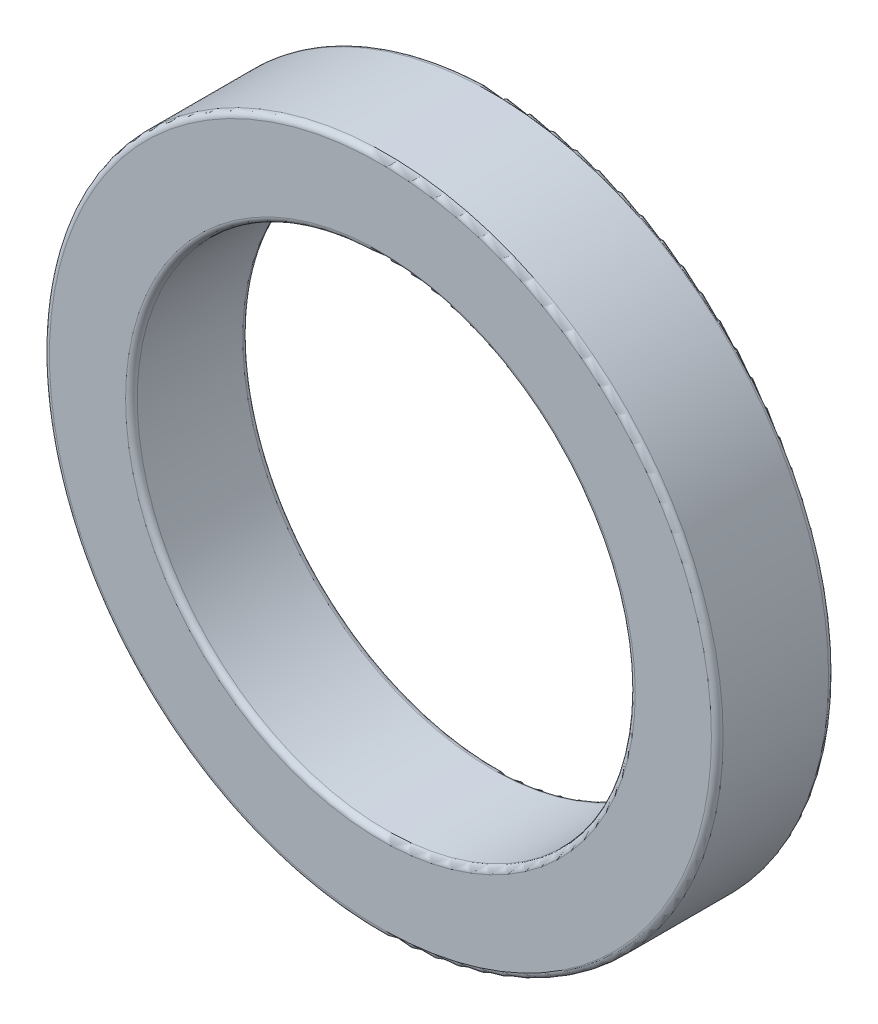
ISO-10303-21;
HEADER;
FILE_DESCRIPTION(('STEP AP214'),'2;1');
FILE_NAME('part.step','',(''),(''),'','','');
FILE_SCHEMA(('AUTOMOTIVE_DESIGN { 1 0 10303 214 1 1 1 1 }'));
ENDSEC;
DATA;
#1=APPLICATION_CONTEXT('core data for automotive mechanical design processes');
#2=APPLICATION_PROTOCOL_DEFINITION('international standard','automotive_design',2000,#1);
#3=PRODUCT_CONTEXT('',#1,'mechanical');
#4=PRODUCT('Part','Part','',(#3));
#5=PRODUCT_RELATED_PRODUCT_CATEGORY('part','',(#4));
#6=PRODUCT_DEFINITION_FORMATION('','',#4);
#7=PRODUCT_DEFINITION_CONTEXT('part definition',#1,'design');
#8=PRODUCT_DEFINITION('design','',#6,#7);
#9=PRODUCT_DEFINITION_SHAPE('','',#8);
#10=(LENGTH_UNIT() NAMED_UNIT(*) SI_UNIT(.MILLI.,.METRE.));
#11=(NAMED_UNIT(*) PLANE_ANGLE_UNIT() SI_UNIT($,.RADIAN.));
#12=(NAMED_UNIT(*) SI_UNIT($,.STERADIAN.) SOLID_ANGLE_UNIT());
#13=UNCERTAINTY_MEASURE_WITH_UNIT(LENGTH_MEASURE(1.E-05),#10,'distance_accuracy_value','');
#14=(GEOMETRIC_REPRESENTATION_CONTEXT(3) GLOBAL_UNCERTAINTY_ASSIGNED_CONTEXT((#13)) GLOBAL_UNIT_ASSIGNED_CONTEXT((#10,
#11,#12)) REPRESENTATION_CONTEXT('',''));
#15=CARTESIAN_POINT('',(0.,0.,0.));
#16=DIRECTION('',(0.,0.,1.));
#17=DIRECTION('',(1.,0.,0.));
#18=AXIS2_PLACEMENT_3D('',#15,#16,#17);
#19=CARTESIAN_POINT('',(0.,0.,4.));
#20=DIRECTION('',(0.,0.,1.));
#21=DIRECTION('',(1.,0.,0.));
#22=AXIS2_PLACEMENT_3D('',#19,#20,#21);
#23=PLANE('',#22);
#24=CARTESIAN_POINT('',(0.,0.,4.));
#25=DIRECTION('',(0.,0.,1.));
#26=DIRECTION('',(1.,0.,0.));
#27=AXIS2_PLACEMENT_3D('',#24,#25,#26);
#28=CIRCLE('',#27,8.7);
#29=CARTESIAN_POINT('',(8.7,0.,4.));
#30=VERTEX_POINT('',#29);
#31=EDGE_CURVE('E10',#30,#30,#28,.F.);
#32=ORIENTED_EDGE('',*,*,#31,.T.);
#33=EDGE_LOOP('',(#32));
#34=FACE_BOUND('',#33,.T.);
#35=CARTESIAN_POINT('',(0.,0.,4.));
#36=DIRECTION('',(0.,0.,1.));
#37=DIRECTION('',(1.,0.,0.));
#38=AXIS2_PLACEMENT_3D('',#35,#36,#37);
#39=CIRCLE('',#38,11.3);
#40=CARTESIAN_POINT('',(11.3,0.,4.));
#41=VERTEX_POINT('',#40);
#42=EDGE_CURVE('E38',#41,#41,#39,.T.);
#43=ORIENTED_EDGE('',*,*,#42,.T.);
#44=EDGE_LOOP('',(#43));
#45=FACE_BOUND('',#44,.T.);
#46=ADVANCED_FACE('F31',(#34,#45),#23,.T.);
#47=CARTESIAN_POINT('',(0.,0.,0.));
#48=DIRECTION('',(0.,0.,1.));
#49=DIRECTION('',(1.,0.,0.));
#50=AXIS2_PLACEMENT_3D('',#47,#48,#49);
#51=PLANE('',#50);
#52=CARTESIAN_POINT('',(0.,0.,0.));
#53=DIRECTION('',(0.,0.,1.));
#54=DIRECTION('',(1.,0.,0.));
#55=AXIS2_PLACEMENT_3D('',#52,#53,#54);
#56=CIRCLE('',#55,8.7);
#57=CARTESIAN_POINT('',(8.7,0.,0.));
#58=VERTEX_POINT('',#57);
#59=EDGE_CURVE('E57',#58,#58,#56,.T.);
#60=ORIENTED_EDGE('',*,*,#59,.T.);
#61=EDGE_LOOP('',(#60));
#62=FACE_BOUND('',#61,.T.);
#63=CARTESIAN_POINT('',(0.,0.,0.));
#64=DIRECTION('',(0.,0.,1.));
#65=DIRECTION('',(1.,0.,0.));
#66=AXIS2_PLACEMENT_3D('',#63,#64,#65);
#67=CIRCLE('',#66,11.3);
#68=CARTESIAN_POINT('',(11.3,0.,0.));
#69=VERTEX_POINT('',#68);
#70=EDGE_CURVE('E60',#69,#69,#67,.F.);
#71=ORIENTED_EDGE('',*,*,#70,.T.);
#72=EDGE_LOOP('',(#71));
#73=FACE_BOUND('',#72,.T.);
#74=ADVANCED_FACE('F64',(#62,#73),#51,.F.);
#75=CARTESIAN_POINT('',(0.,0.,4.));
#76=DIRECTION('',(0.,0.,-1.));
#77=DIRECTION('',(-1.,0.,0.));
#78=AXIS2_PLACEMENT_3D('',#75,#76,#77);
#79=CYLINDRICAL_SURFACE('',#78,11.5);
#80=CARTESIAN_POINT('',(0.,0.,0.2));
#81=DIRECTION('',(0.,0.,1.));
#82=DIRECTION('',(1.,0.,0.));
#83=AXIS2_PLACEMENT_3D('',#80,#81,#82);
#84=CIRCLE('',#83,11.5);
#85=CARTESIAN_POINT('',(11.5,0.,0.2));
#86=VERTEX_POINT('',#85);
#87=EDGE_CURVE('E42',#86,#86,#84,.T.);
#88=ORIENTED_EDGE('',*,*,#87,.T.);
#89=EDGE_LOOP('',(#88));
#90=FACE_BOUND('',#89,.T.);
#91=CARTESIAN_POINT('',(0.,0.,3.8));
#92=DIRECTION('',(0.,0.,1.));
#93=DIRECTION('',(1.,0.,0.));
#94=AXIS2_PLACEMENT_3D('',#91,#92,#93);
#95=CIRCLE('',#94,11.5);
#96=CARTESIAN_POINT('',(11.5,0.,3.8));
#97=VERTEX_POINT('',#96);
#98=EDGE_CURVE('E46',#97,#97,#95,.F.);
#99=ORIENTED_EDGE('',*,*,#98,.T.);
#100=EDGE_LOOP('',(#99));
#101=FACE_BOUND('',#100,.T.);
#102=ADVANCED_FACE('F74',(#90,#101),#79,.T.);
#103=CARTESIAN_POINT('',(0.,0.,4.));
#104=DIRECTION('',(0.,0.,-1.));
#105=DIRECTION('',(-1.,0.,0.));
#106=AXIS2_PLACEMENT_3D('',#103,#104,#105);
#107=CYLINDRICAL_SURFACE('',#106,8.5);
#108=CARTESIAN_POINT('',(0.,0.,0.2));
#109=DIRECTION('',(0.,0.,1.));
#110=DIRECTION('',(1.,0.,0.));
#111=AXIS2_PLACEMENT_3D('',#108,#109,#110);
#112=CIRCLE('',#111,8.5);
#113=CARTESIAN_POINT('',(8.5,0.,0.2));
#114=VERTEX_POINT('',#113);
#115=EDGE_CURVE('E51',#114,#114,#112,.F.);
#116=ORIENTED_EDGE('',*,*,#115,.T.);
#117=EDGE_LOOP('',(#116));
#118=FACE_BOUND('',#117,.T.);
#119=CARTESIAN_POINT('',(0.,0.,3.8));
#120=DIRECTION('',(0.,0.,1.));
#121=DIRECTION('',(1.,0.,0.));
#122=AXIS2_PLACEMENT_3D('',#119,#120,#121);
#123=CIRCLE('',#122,8.5);
#124=CARTESIAN_POINT('',(8.5,0.,3.8));
#125=VERTEX_POINT('',#124);
#126=EDGE_CURVE('E54',#125,#125,#123,.T.);
#127=ORIENTED_EDGE('',*,*,#126,.T.);
#128=EDGE_LOOP('',(#127));
#129=FACE_BOUND('',#128,.T.);
#130=ADVANCED_FACE('F77',(#118,#129),#107,.F.);
#131=CARTESIAN_POINT('',(0.,0.,0.2));
#132=DIRECTION('',(0.,0.,1.));
#133=DIRECTION('',(1.,0.,0.));
#134=AXIS2_PLACEMENT_3D('',#131,#132,#133);
#135=TOROIDAL_SURFACE('',#134,8.7,0.2);
#136=ORIENTED_EDGE('',*,*,#115,.F.);
#137=EDGE_LOOP('',(#136));
#138=FACE_BOUND('',#137,.T.);
#139=ORIENTED_EDGE('',*,*,#59,.F.);
#140=EDGE_LOOP('',(#139));
#141=FACE_BOUND('',#140,.T.);
#142=ADVANCED_FACE('F70',(#138,#141),#135,.T.);
#143=CARTESIAN_POINT('',(0.,0.,0.2));
#144=DIRECTION('',(0.,0.,1.));
#145=DIRECTION('',(1.,0.,0.));
#146=AXIS2_PLACEMENT_3D('',#143,#144,#145);
#147=TOROIDAL_SURFACE('',#146,11.3,0.2);
#148=ORIENTED_EDGE('',*,*,#70,.F.);
#149=EDGE_LOOP('',(#148));
#150=FACE_BOUND('',#149,.T.);
#151=ORIENTED_EDGE('',*,*,#87,.F.);
#152=EDGE_LOOP('',(#151));
#153=FACE_BOUND('',#152,.T.);
#154=ADVANCED_FACE('F66',(#150,#153),#147,.T.);
#155=CARTESIAN_POINT('',(0.,0.,3.8));
#156=DIRECTION('',(0.,0.,1.));
#157=DIRECTION('',(1.,0.,0.));
#158=AXIS2_PLACEMENT_3D('',#155,#156,#157);
#159=TOROIDAL_SURFACE('',#158,8.7,0.2);
#160=ORIENTED_EDGE('',*,*,#31,.F.);
#161=EDGE_LOOP('',(#160));
#162=FACE_BOUND('',#161,.T.);
#163=ORIENTED_EDGE('',*,*,#126,.F.);
#164=EDGE_LOOP('',(#163));
#165=FACE_BOUND('',#164,.T.);
#166=ADVANCED_FACE('F69',(#162,#165),#159,.T.);
#167=CARTESIAN_POINT('',(0.,0.,3.8));
#168=DIRECTION('',(0.,0.,1.));
#169=DIRECTION('',(1.,0.,0.));
#170=AXIS2_PLACEMENT_3D('',#167,#168,#169);
#171=TOROIDAL_SURFACE('',#170,11.3,0.2);
#172=ORIENTED_EDGE('',*,*,#98,.F.);
#173=EDGE_LOOP('',(#172));
#174=FACE_BOUND('',#173,.T.);
#175=ORIENTED_EDGE('',*,*,#42,.F.);
#176=EDGE_LOOP('',(#175));
#177=FACE_BOUND('',#176,.T.);
#178=ADVANCED_FACE('F33',(#174,#177),#171,.T.);
#179=CLOSED_SHELL('',(#46,#74,#102,#130,#142,#154,#166,#178));
#180=MANIFOLD_SOLID_BREP('B2',#179);
#181=ADVANCED_BREP_SHAPE_REPRESENTATION('',(#18,#180),#14);
#182=SHAPE_DEFINITION_REPRESENTATION(#9,#181);
ENDSEC;
END-ISO-10303-21;
